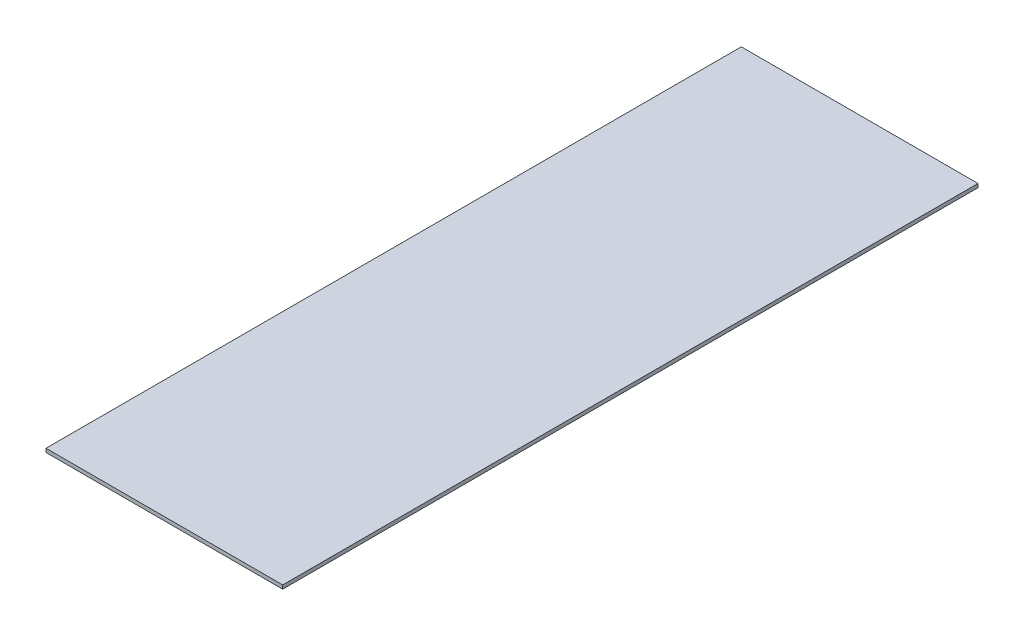
ISO-10303-21;
HEADER;
FILE_DESCRIPTION(('STEP AP214'),'2;1');
FILE_NAME('part.step','',(''),(''),'','','');
FILE_SCHEMA(('AUTOMOTIVE_DESIGN { 1 0 10303 214 1 1 1 1 }'));
ENDSEC;
DATA;
#1=APPLICATION_CONTEXT('core data for automotive mechanical design processes');
#2=APPLICATION_PROTOCOL_DEFINITION('international standard','automotive_design',2000,#1);
#3=PRODUCT_CONTEXT('',#1,'mechanical');
#4=PRODUCT('Part','Part','',(#3));
#5=PRODUCT_RELATED_PRODUCT_CATEGORY('part','',(#4));
#6=PRODUCT_DEFINITION_FORMATION('','',#4);
#7=PRODUCT_DEFINITION_CONTEXT('part definition',#1,'design');
#8=PRODUCT_DEFINITION('design','',#6,#7);
#9=PRODUCT_DEFINITION_SHAPE('','',#8);
#10=(LENGTH_UNIT() NAMED_UNIT(*) SI_UNIT(.MILLI.,.METRE.));
#11=(NAMED_UNIT(*) PLANE_ANGLE_UNIT() SI_UNIT($,.RADIAN.));
#12=(NAMED_UNIT(*) SI_UNIT($,.STERADIAN.) SOLID_ANGLE_UNIT());
#13=UNCERTAINTY_MEASURE_WITH_UNIT(LENGTH_MEASURE(1.E-05),#10,'distance_accuracy_value','');
#14=(GEOMETRIC_REPRESENTATION_CONTEXT(3) GLOBAL_UNCERTAINTY_ASSIGNED_CONTEXT((#13)) GLOBAL_UNIT_ASSIGNED_CONTEXT((#10,
#11,#12)) REPRESENTATION_CONTEXT('',''));
#15=CARTESIAN_POINT('',(0.,0.,0.));
#16=DIRECTION('',(0.,0.,1.));
#17=DIRECTION('',(1.,0.,0.));
#18=AXIS2_PLACEMENT_3D('',#15,#16,#17);
#19=CARTESIAN_POINT('',(-25.4,0.79375,-74.6125));
#20=DIRECTION('',(1.,0.,0.));
#21=DIRECTION('',(0.,0.,-1.));
#22=AXIS2_PLACEMENT_3D('',#19,#20,#21);
#23=PLANE('',#22);
#24=DIRECTION('',(0.,0.,1.));
#25=VECTOR('',#24,1.);
#26=CARTESIAN_POINT('',(-25.4,0.,-74.6125));
#27=LINE('',#26,#25);
#28=CARTESIAN_POINT('',(-25.4,0.,-74.6125));
#29=VERTEX_POINT('',#28);
#30=CARTESIAN_POINT('',(-25.4,0.,74.6125));
#31=VERTEX_POINT('',#30);
#32=EDGE_CURVE('E98',#29,#31,#27,.T.);
#33=ORIENTED_EDGE('',*,*,#32,.T.);
#34=DIRECTION('',(0.,-1.,0.));
#35=VECTOR('',#34,1.);
#36=CARTESIAN_POINT('',(-25.4,0.79375,74.6125));
#37=LINE('',#36,#35);
#38=CARTESIAN_POINT('',(-25.4,0.79375,74.6125));
#39=VERTEX_POINT('',#38);
#40=EDGE_CURVE('E11',#39,#31,#37,.T.);
#41=ORIENTED_EDGE('',*,*,#40,.F.);
#42=DIRECTION('',(0.,0.,1.));
#43=VECTOR('',#42,1.);
#44=CARTESIAN_POINT('',(-25.4,0.79375,-74.6125));
#45=LINE('',#44,#43);
#46=CARTESIAN_POINT('',(-25.4,0.79375,-74.6125));
#47=VERTEX_POINT('',#46);
#48=EDGE_CURVE('E86',#47,#39,#45,.T.);
#49=ORIENTED_EDGE('',*,*,#48,.F.);
#50=DIRECTION('',(0.,-1.,0.));
#51=VECTOR('',#50,1.);
#52=CARTESIAN_POINT('',(-25.4,0.79375,-74.6125));
#53=LINE('',#52,#51);
#54=EDGE_CURVE('E94',#47,#29,#53,.T.);
#55=ORIENTED_EDGE('',*,*,#54,.T.);
#56=EDGE_LOOP('',(#33,#41,#49,#55));
#57=FACE_BOUND('',#56,.T.);
#58=ADVANCED_FACE('F35',(#57),#23,.F.);
#59=CARTESIAN_POINT('',(-25.4,0.79375,74.6125));
#60=DIRECTION('',(0.,0.,-1.));
#61=DIRECTION('',(-1.,0.,0.));
#62=AXIS2_PLACEMENT_3D('',#59,#60,#61);
#63=PLANE('',#62);
#64=DIRECTION('',(1.,0.,0.));
#65=VECTOR('',#64,1.);
#66=CARTESIAN_POINT('',(-25.4,0.,74.6125));
#67=LINE('',#66,#65);
#68=CARTESIAN_POINT('',(25.4,0.,74.6125));
#69=VERTEX_POINT('',#68);
#70=EDGE_CURVE('E90',#31,#69,#67,.T.);
#71=ORIENTED_EDGE('',*,*,#70,.T.);
#72=DIRECTION('',(0.,-1.,0.));
#73=VECTOR('',#72,1.);
#74=CARTESIAN_POINT('',(25.4,0.79375,74.6125));
#75=LINE('',#74,#73);
#76=CARTESIAN_POINT('',(25.4,0.79375,74.6125));
#77=VERTEX_POINT('',#76);
#78=EDGE_CURVE('E43',#77,#69,#75,.T.);
#79=ORIENTED_EDGE('',*,*,#78,.F.);
#80=DIRECTION('',(1.,0.,0.));
#81=VECTOR('',#80,1.);
#82=CARTESIAN_POINT('',(-25.4,0.79375,74.6125));
#83=LINE('',#82,#81);
#84=EDGE_CURVE('E81',#39,#77,#83,.T.);
#85=ORIENTED_EDGE('',*,*,#84,.F.);
#86=ORIENTED_EDGE('',*,*,#40,.T.);
#87=EDGE_LOOP('',(#71,#79,#85,#86));
#88=FACE_BOUND('',#87,.T.);
#89=ADVANCED_FACE('F89',(#88),#63,.F.);
#90=CARTESIAN_POINT('',(25.4,0.79375,74.6125));
#91=DIRECTION('',(-1.,0.,0.));
#92=DIRECTION('',(0.,0.,1.));
#93=AXIS2_PLACEMENT_3D('',#90,#91,#92);
#94=PLANE('',#93);
#95=DIRECTION('',(0.,0.,-1.));
#96=VECTOR('',#95,1.);
#97=CARTESIAN_POINT('',(25.4,0.,74.6125));
#98=LINE('',#97,#96);
#99=CARTESIAN_POINT('',(25.4,0.,-74.6125));
#100=VERTEX_POINT('',#99);
#101=EDGE_CURVE('E68',#69,#100,#98,.T.);
#102=ORIENTED_EDGE('',*,*,#101,.T.);
#103=DIRECTION('',(0.,-1.,0.));
#104=VECTOR('',#103,1.);
#105=CARTESIAN_POINT('',(25.4,0.79375,-74.6125));
#106=LINE('',#105,#104);
#107=CARTESIAN_POINT('',(25.4,0.79375,-74.6125));
#108=VERTEX_POINT('',#107);
#109=EDGE_CURVE('E91',#108,#100,#106,.T.);
#110=ORIENTED_EDGE('',*,*,#109,.F.);
#111=DIRECTION('',(0.,0.,-1.));
#112=VECTOR('',#111,1.);
#113=CARTESIAN_POINT('',(25.4,0.79375,74.6125));
#114=LINE('',#113,#112);
#115=EDGE_CURVE('E84',#77,#108,#114,.T.);
#116=ORIENTED_EDGE('',*,*,#115,.F.);
#117=ORIENTED_EDGE('',*,*,#78,.T.);
#118=EDGE_LOOP('',(#102,#110,#116,#117));
#119=FACE_BOUND('',#118,.T.);
#120=ADVANCED_FACE('F92',(#119),#94,.F.);
#121=CARTESIAN_POINT('',(25.4,0.79375,-74.6125));
#122=DIRECTION('',(0.,0.,1.));
#123=DIRECTION('',(1.,0.,0.));
#124=AXIS2_PLACEMENT_3D('',#121,#122,#123);
#125=PLANE('',#124);
#126=DIRECTION('',(-1.,0.,0.));
#127=VECTOR('',#126,1.);
#128=CARTESIAN_POINT('',(25.4,0.,-74.6125));
#129=LINE('',#128,#127);
#130=EDGE_CURVE('E74',#100,#29,#129,.T.);
#131=ORIENTED_EDGE('',*,*,#130,.T.);
#132=ORIENTED_EDGE('',*,*,#54,.F.);
#133=DIRECTION('',(-1.,0.,0.));
#134=VECTOR('',#133,1.);
#135=CARTESIAN_POINT('',(25.4,0.79375,-74.6125));
#136=LINE('',#135,#134);
#137=EDGE_CURVE('E51',#108,#47,#136,.T.);
#138=ORIENTED_EDGE('',*,*,#137,.F.);
#139=ORIENTED_EDGE('',*,*,#109,.T.);
#140=EDGE_LOOP('',(#131,#132,#138,#139));
#141=FACE_BOUND('',#140,.T.);
#142=ADVANCED_FACE('F105',(#141),#125,.F.);
#143=CARTESIAN_POINT('',(0.,0.79375,0.));
#144=DIRECTION('',(0.,1.,0.));
#145=DIRECTION('',(0.,0.,1.));
#146=AXIS2_PLACEMENT_3D('',#143,#144,#145);
#147=PLANE('',#146);
#148=ORIENTED_EDGE('',*,*,#48,.T.);
#149=ORIENTED_EDGE('',*,*,#84,.T.);
#150=ORIENTED_EDGE('',*,*,#115,.T.);
#151=ORIENTED_EDGE('',*,*,#137,.T.);
#152=EDGE_LOOP('',(#148,#149,#150,#151));
#153=FACE_BOUND('',#152,.T.);
#154=ADVANCED_FACE('F82',(#153),#147,.T.);
#155=CARTESIAN_POINT('',(0.,0.,0.));
#156=DIRECTION('',(0.,1.,0.));
#157=DIRECTION('',(0.,0.,1.));
#158=AXIS2_PLACEMENT_3D('',#155,#156,#157);
#159=PLANE('',#158);
#160=ORIENTED_EDGE('',*,*,#32,.F.);
#161=ORIENTED_EDGE('',*,*,#130,.F.);
#162=ORIENTED_EDGE('',*,*,#101,.F.);
#163=ORIENTED_EDGE('',*,*,#70,.F.);
#164=EDGE_LOOP('',(#160,#161,#162,#163));
#165=FACE_BOUND('',#164,.T.);
#166=ADVANCED_FACE('F108',(#165),#159,.F.);
#167=CLOSED_SHELL('',(#58,#89,#120,#142,#154,#166));
#168=MANIFOLD_SOLID_BREP('B2',#167);
#169=ADVANCED_BREP_SHAPE_REPRESENTATION('',(#18,#168),#14);
#170=SHAPE_DEFINITION_REPRESENTATION(#9,#169);
ENDSEC;
END-ISO-10303-21;
